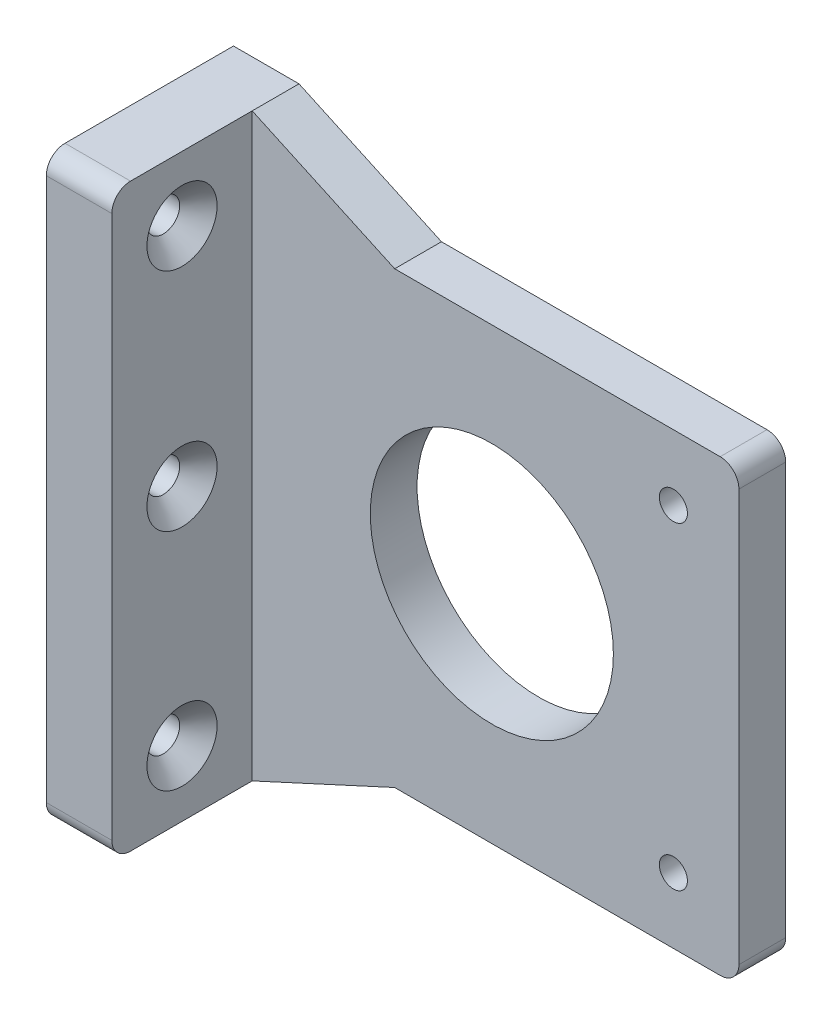
ISO-10303-21;
HEADER;
FILE_DESCRIPTION(('STEP AP214'),'2;1');
FILE_NAME('part.step','',(''),(''),'','','');
FILE_SCHEMA(('AUTOMOTIVE_DESIGN { 1 0 10303 214 1 1 1 1 }'));
ENDSEC;
DATA;
#1=APPLICATION_CONTEXT('core data for automotive mechanical design processes');
#2=APPLICATION_PROTOCOL_DEFINITION('international standard','automotive_design',2000,#1);
#3=PRODUCT_CONTEXT('',#1,'mechanical');
#4=PRODUCT('Part','Part','',(#3));
#5=PRODUCT_RELATED_PRODUCT_CATEGORY('part','',(#4));
#6=PRODUCT_DEFINITION_FORMATION('','',#4);
#7=PRODUCT_DEFINITION_CONTEXT('part definition',#1,'design');
#8=PRODUCT_DEFINITION('design','',#6,#7);
#9=PRODUCT_DEFINITION_SHAPE('','',#8);
#10=(LENGTH_UNIT() NAMED_UNIT(*) SI_UNIT(.MILLI.,.METRE.));
#11=(NAMED_UNIT(*) PLANE_ANGLE_UNIT() SI_UNIT($,.RADIAN.));
#12=(NAMED_UNIT(*) SI_UNIT($,.STERADIAN.) SOLID_ANGLE_UNIT());
#13=UNCERTAINTY_MEASURE_WITH_UNIT(LENGTH_MEASURE(1.E-05),#10,'distance_accuracy_value','');
#14=(GEOMETRIC_REPRESENTATION_CONTEXT(3) GLOBAL_UNCERTAINTY_ASSIGNED_CONTEXT((#13)) GLOBAL_UNIT_ASSIGNED_CONTEXT((#10,
#11,#12)) REPRESENTATION_CONTEXT('',''));
#15=CARTESIAN_POINT('',(0.,0.,0.));
#16=DIRECTION('',(0.,0.,1.));
#17=DIRECTION('',(1.,0.,0.));
#18=AXIS2_PLACEMENT_3D('',#15,#16,#17);
#19=CARTESIAN_POINT('',(-10.9580010754682,23.8294035119056,5.));
#20=DIRECTION('',(0.417794694081964,-0.908541464984927,0.));
#21=DIRECTION('',(0.908541464984927,0.417794694081964,0.));
#22=AXIS2_PLACEMENT_3D('',#19,#20,#21);
#23=PLANE('',#22);
#24=DIRECTION('',(-0.908541464984927,-0.417794694081964,0.));
#25=VECTOR('',#24,1.);
#26=CARTESIAN_POINT('',(-10.9580010754682,23.8294035119056,0.));
#27=LINE('',#26,#25);
#28=CARTESIAN_POINT('',(-62.7777141620501,0.,0.));
#29=VERTEX_POINT('',#28);
#30=CARTESIAN_POINT('',(-78.,-7.,0.));
#31=VERTEX_POINT('',#30);
#32=EDGE_CURVE('E162',#29,#31,#27,.T.);
#33=ORIENTED_EDGE('',*,*,#32,.F.);
#34=DIRECTION('',(0.,0.,-1.));
#35=VECTOR('',#34,1.);
#36=CARTESIAN_POINT('',(-62.7777141620501,0.,5.));
#37=LINE('',#36,#35);
#38=CARTESIAN_POINT('',(-62.7777141620501,0.,5.));
#39=VERTEX_POINT('',#38);
#40=EDGE_CURVE('E175',#39,#29,#37,.T.);
#41=ORIENTED_EDGE('',*,*,#40,.F.);
#42=DIRECTION('',(-0.908541464984927,-0.417794694081964,0.));
#43=VECTOR('',#42,1.);
#44=CARTESIAN_POINT('',(-10.9580010754682,23.8294035119056,5.));
#45=LINE('',#44,#43);
#46=CARTESIAN_POINT('',(-78.,-7.,5.));
#47=VERTEX_POINT('',#46);
#48=EDGE_CURVE('E158',#39,#47,#45,.T.);
#49=ORIENTED_EDGE('',*,*,#48,.T.);
#50=DIRECTION('',(0.,0.,-1.));
#51=VECTOR('',#50,1.);
#52=CARTESIAN_POINT('',(-78.,-7.,5.));
#53=LINE('',#52,#51);
#54=EDGE_CURVE('E165',#47,#31,#53,.T.);
#55=ORIENTED_EDGE('',*,*,#54,.T.);
#56=EDGE_LOOP('',(#33,#41,#49,#55));
#57=FACE_BOUND('',#56,.T.);
#58=ADVANCED_FACE('F39',(#57),#23,.T.);
#59=CARTESIAN_POINT('',(0.,0.,5.));
#60=DIRECTION('',(0.,1.,0.));
#61=DIRECTION('',(0.,0.,1.));
#62=AXIS2_PLACEMENT_3D('',#59,#60,#61);
#63=PLANE('',#62);
#64=DIRECTION('',(1.,0.,0.));
#65=VECTOR('',#64,1.);
#66=CARTESIAN_POINT('',(0.,0.,0.));
#67=LINE('',#66,#65);
#68=CARTESIAN_POINT('',(-28.,0.,0.));
#69=VERTEX_POINT('',#68);
#70=EDGE_CURVE('E199',#29,#69,#67,.T.);
#71=ORIENTED_EDGE('',*,*,#70,.T.);
#72=DIRECTION('',(0.,0.,-1.));
#73=VECTOR('',#72,1.);
#74=CARTESIAN_POINT('',(-28.,0.,5.));
#75=LINE('',#74,#73);
#76=CARTESIAN_POINT('',(-28.,0.,5.));
#77=VERTEX_POINT('',#76);
#78=EDGE_CURVE('E255',#69,#77,#75,.F.);
#79=ORIENTED_EDGE('',*,*,#78,.T.);
#80=DIRECTION('',(1.,0.,0.));
#81=VECTOR('',#80,1.);
#82=CARTESIAN_POINT('',(0.,0.,5.));
#83=LINE('',#82,#81);
#84=EDGE_CURVE('E177',#39,#77,#83,.T.);
#85=ORIENTED_EDGE('',*,*,#84,.F.);
#86=ORIENTED_EDGE('',*,*,#40,.T.);
#87=EDGE_LOOP('',(#71,#79,#85,#86));
#88=FACE_BOUND('',#87,.T.);
#89=ADVANCED_FACE('F312',(#88),#63,.F.);
#90=CARTESIAN_POINT('',(-26.,0.,5.));
#91=DIRECTION('',(1.,0.,0.));
#92=DIRECTION('',(0.,0.,-1.));
#93=AXIS2_PLACEMENT_3D('',#90,#91,#92);
#94=PLANE('',#93);
#95=DIRECTION('',(0.,-1.,0.));
#96=VECTOR('',#95,1.);
#97=CARTESIAN_POINT('',(-26.,0.,5.));
#98=LINE('',#97,#96);
#99=CARTESIAN_POINT('',(-26.,46.,5.));
#100=VERTEX_POINT('',#99);
#101=CARTESIAN_POINT('',(-26.,2.,5.));
#102=VERTEX_POINT('',#101);
#103=EDGE_CURVE('E180',#100,#102,#98,.T.);
#104=ORIENTED_EDGE('',*,*,#103,.T.);
#105=DIRECTION('',(0.,0.,-1.));
#106=VECTOR('',#105,1.);
#107=CARTESIAN_POINT('',(-26.,2.,0.));
#108=LINE('',#107,#106);
#109=CARTESIAN_POINT('',(-26.,2.,0.));
#110=VERTEX_POINT('',#109);
#111=EDGE_CURVE('E248',#102,#110,#108,.T.);
#112=ORIENTED_EDGE('',*,*,#111,.T.);
#113=DIRECTION('',(0.,-1.,0.));
#114=VECTOR('',#113,1.);
#115=CARTESIAN_POINT('',(-26.,0.,0.));
#116=LINE('',#115,#114);
#117=CARTESIAN_POINT('',(-26.,46.,0.));
#118=VERTEX_POINT('',#117);
#119=EDGE_CURVE('E202',#118,#110,#116,.T.);
#120=ORIENTED_EDGE('',*,*,#119,.F.);
#121=DIRECTION('',(0.,0.,-1.));
#122=VECTOR('',#121,1.);
#123=CARTESIAN_POINT('',(-26.,46.,5.));
#124=LINE('',#123,#122);
#125=EDGE_CURVE('E246',#118,#100,#124,.F.);
#126=ORIENTED_EDGE('',*,*,#125,.T.);
#127=EDGE_LOOP('',(#104,#112,#120,#126));
#128=FACE_BOUND('',#127,.T.);
#129=ADVANCED_FACE('F317',(#128),#94,.T.);
#130=CARTESIAN_POINT('',(0.,48.,5.));
#131=DIRECTION('',(0.,1.,0.));
#132=DIRECTION('',(0.,0.,1.));
#133=AXIS2_PLACEMENT_3D('',#130,#131,#132);
#134=PLANE('',#133);
#135=DIRECTION('',(1.,0.,0.));
#136=VECTOR('',#135,1.);
#137=CARTESIAN_POINT('',(0.,48.,5.));
#138=LINE('',#137,#136);
#139=CARTESIAN_POINT('',(-62.7777141620501,48.,5.));
#140=VERTEX_POINT('',#139);
#141=CARTESIAN_POINT('',(-28.,48.,5.));
#142=VERTEX_POINT('',#141);
#143=EDGE_CURVE('E189',#140,#142,#138,.T.);
#144=ORIENTED_EDGE('',*,*,#143,.T.);
#145=DIRECTION('',(0.,0.,-1.));
#146=VECTOR('',#145,1.);
#147=CARTESIAN_POINT('',(-28.,48.,5.));
#148=LINE('',#147,#146);
#149=CARTESIAN_POINT('',(-28.,48.,0.));
#150=VERTEX_POINT('',#149);
#151=EDGE_CURVE('E261',#142,#150,#148,.T.);
#152=ORIENTED_EDGE('',*,*,#151,.T.);
#153=DIRECTION('',(1.,0.,0.));
#154=VECTOR('',#153,1.);
#155=CARTESIAN_POINT('',(0.,48.,0.));
#156=LINE('',#155,#154);
#157=CARTESIAN_POINT('',(-62.7777141620501,48.,0.));
#158=VERTEX_POINT('',#157);
#159=EDGE_CURVE('E205',#158,#150,#156,.T.);
#160=ORIENTED_EDGE('',*,*,#159,.F.);
#161=DIRECTION('',(0.,0.,-1.));
#162=VECTOR('',#161,1.);
#163=CARTESIAN_POINT('',(-62.7777141620501,48.,5.));
#164=LINE('',#163,#162);
#165=EDGE_CURVE('E225',#140,#158,#164,.T.);
#166=ORIENTED_EDGE('',*,*,#165,.F.);
#167=EDGE_LOOP('',(#144,#152,#160,#166));
#168=FACE_BOUND('',#167,.T.);
#169=ADVANCED_FACE('F348',(#168),#134,.T.);
#170=CARTESIAN_POINT('',(7.26202148889138,15.7920809807484,5.));
#171=DIRECTION('',(0.417794694081964,0.908541464984927,0.));
#172=DIRECTION('',(-0.908541464984927,0.417794694081964,0.));
#173=AXIS2_PLACEMENT_3D('',#170,#171,#172);
#174=PLANE('',#173);
#175=DIRECTION('',(0.908541464984927,-0.417794694081964,0.));
#176=VECTOR('',#175,1.);
#177=CARTESIAN_POINT('',(7.26202148889138,15.7920809807484,0.));
#178=LINE('',#177,#176);
#179=CARTESIAN_POINT('',(-78.,55.,0.));
#180=VERTEX_POINT('',#179);
#181=EDGE_CURVE('E208',#180,#158,#178,.T.);
#182=ORIENTED_EDGE('',*,*,#181,.F.);
#183=DIRECTION('',(0.,0.,-1.));
#184=VECTOR('',#183,1.);
#185=CARTESIAN_POINT('',(-78.,55.,5.));
#186=LINE('',#185,#184);
#187=CARTESIAN_POINT('',(-78.,55.,5.));
#188=VERTEX_POINT('',#187);
#189=EDGE_CURVE('E223',#188,#180,#186,.T.);
#190=ORIENTED_EDGE('',*,*,#189,.F.);
#191=DIRECTION('',(0.908541464984927,-0.417794694081964,0.));
#192=VECTOR('',#191,1.);
#193=CARTESIAN_POINT('',(7.26202148889138,15.7920809807484,5.));
#194=LINE('',#193,#192);
#195=EDGE_CURVE('E161',#188,#140,#194,.T.);
#196=ORIENTED_EDGE('',*,*,#195,.T.);
#197=ORIENTED_EDGE('',*,*,#165,.T.);
#198=EDGE_LOOP('',(#182,#190,#196,#197));
#199=FACE_BOUND('',#198,.T.);
#200=ADVANCED_FACE('F296',(#199),#174,.T.);
#201=CARTESIAN_POINT('',(0.,55.,5.));
#202=DIRECTION('',(0.,1.,0.));
#203=DIRECTION('',(0.,0.,1.));
#204=AXIS2_PLACEMENT_3D('',#201,#202,#203);
#205=PLANE('',#204);
#206=DIRECTION('',(0.,0.,-1.));
#207=VECTOR('',#206,1.);
#208=CARTESIAN_POINT('',(-85.,55.,5.));
#209=LINE('',#208,#207);
#210=CARTESIAN_POINT('',(-85.,55.,18.));
#211=VERTEX_POINT('',#210);
#212=CARTESIAN_POINT('',(-85.,55.,0.));
#213=VERTEX_POINT('',#212);
#214=EDGE_CURVE('E221',#211,#213,#209,.T.);
#215=ORIENTED_EDGE('',*,*,#214,.F.);
#216=DIRECTION('',(1.,0.,0.));
#217=VECTOR('',#216,1.);
#218=CARTESIAN_POINT('',(0.,55.,18.));
#219=LINE('',#218,#217);
#220=CARTESIAN_POINT('',(-78.,55.,18.));
#221=VERTEX_POINT('',#220);
#222=EDGE_CURVE('E264',#211,#221,#219,.T.);
#223=ORIENTED_EDGE('',*,*,#222,.T.);
#224=DIRECTION('',(0.,0.,-1.));
#225=VECTOR('',#224,1.);
#226=CARTESIAN_POINT('',(-78.,55.,20.));
#227=LINE('',#226,#225);
#228=EDGE_CURVE('E148',#221,#188,#227,.T.);
#229=ORIENTED_EDGE('',*,*,#228,.T.);
#230=ORIENTED_EDGE('',*,*,#189,.T.);
#231=DIRECTION('',(1.,0.,0.));
#232=VECTOR('',#231,1.);
#233=CARTESIAN_POINT('',(0.,55.,0.));
#234=LINE('',#233,#232);
#235=EDGE_CURVE('E211',#213,#180,#234,.T.);
#236=ORIENTED_EDGE('',*,*,#235,.F.);
#237=EDGE_LOOP('',(#215,#223,#229,#230,#236));
#238=FACE_BOUND('',#237,.T.);
#239=ADVANCED_FACE('F283',(#238),#205,.T.);
#240=CARTESIAN_POINT('',(-85.,0.,5.));
#241=DIRECTION('',(-1.,0.,0.));
#242=DIRECTION('',(0.,0.,1.));
#243=AXIS2_PLACEMENT_3D('',#240,#241,#242);
#244=PLANE('',#243);
#245=CARTESIAN_POINT('',(-85.,24.,12.5));
#246=DIRECTION('',(-1.,0.,0.));
#247=DIRECTION('',(0.,0.,1.));
#248=AXIS2_PLACEMENT_3D('',#245,#246,#247);
#249=CIRCLE('',#248,1.75);
#250=CARTESIAN_POINT('',(-85.,24.,14.25));
#251=VERTEX_POINT('',#250);
#252=EDGE_CURVE('E291',#251,#251,#249,.T.);
#253=ORIENTED_EDGE('',*,*,#252,.F.);
#254=EDGE_LOOP('',(#253));
#255=FACE_BOUND('',#254,.T.);
#256=CARTESIAN_POINT('',(-85.,48.1060776493848,12.5));
#257=DIRECTION('',(-1.,0.,0.));
#258=DIRECTION('',(0.,0.,1.));
#259=AXIS2_PLACEMENT_3D('',#256,#257,#258);
#260=CIRCLE('',#259,1.75);
#261=CARTESIAN_POINT('',(-85.,48.1060776493848,14.25));
#262=VERTEX_POINT('',#261);
#263=EDGE_CURVE('E405',#262,#262,#260,.T.);
#264=ORIENTED_EDGE('',*,*,#263,.F.);
#265=EDGE_LOOP('',(#264));
#266=FACE_BOUND('',#265,.T.);
#267=CARTESIAN_POINT('',(-85.,0.,12.5));
#268=DIRECTION('',(-1.,0.,0.));
#269=DIRECTION('',(0.,0.,1.));
#270=AXIS2_PLACEMENT_3D('',#267,#268,#269);
#271=CIRCLE('',#270,1.75);
#272=CARTESIAN_POINT('',(-85.,0.,14.25));
#273=VERTEX_POINT('',#272);
#274=EDGE_CURVE('E287',#273,#273,#271,.T.);
#275=ORIENTED_EDGE('',*,*,#274,.F.);
#276=EDGE_LOOP('',(#275));
#277=FACE_BOUND('',#276,.T.);
#278=DIRECTION('',(0.,1.,0.));
#279=VECTOR('',#278,1.);
#280=CARTESIAN_POINT('',(-85.,0.,20.));
#281=LINE('',#280,#279);
#282=CARTESIAN_POINT('',(-85.,-5.,20.));
#283=VERTEX_POINT('',#282);
#284=CARTESIAN_POINT('',(-85.,53.,20.));
#285=VERTEX_POINT('',#284);
#286=EDGE_CURVE('E149',#283,#285,#281,.T.);
#287=ORIENTED_EDGE('',*,*,#286,.T.);
#288=CARTESIAN_POINT('',(-85.,53.,18.));
#289=DIRECTION('',(-1.,0.,0.));
#290=DIRECTION('',(0.,0.,1.));
#291=AXIS2_PLACEMENT_3D('',#288,#289,#290);
#292=CIRCLE('',#291,2.);
#293=EDGE_CURVE('E48',#285,#211,#292,.T.);
#294=ORIENTED_EDGE('',*,*,#293,.T.);
#295=ORIENTED_EDGE('',*,*,#214,.T.);
#296=DIRECTION('',(0.,1.,0.));
#297=VECTOR('',#296,1.);
#298=CARTESIAN_POINT('',(-85.,0.,0.));
#299=LINE('',#298,#297);
#300=CARTESIAN_POINT('',(-85.,-7.,0.));
#301=VERTEX_POINT('',#300);
#302=EDGE_CURVE('E214',#301,#213,#299,.T.);
#303=ORIENTED_EDGE('',*,*,#302,.F.);
#304=DIRECTION('',(0.,0.,-1.));
#305=VECTOR('',#304,1.);
#306=CARTESIAN_POINT('',(-85.,-7.,5.));
#307=LINE('',#306,#305);
#308=CARTESIAN_POINT('',(-85.,-7.,18.));
#309=VERTEX_POINT('',#308);
#310=EDGE_CURVE('E172',#309,#301,#307,.T.);
#311=ORIENTED_EDGE('',*,*,#310,.F.);
#312=CARTESIAN_POINT('',(-85.,-5.,18.));
#313=DIRECTION('',(-1.,0.,0.));
#314=DIRECTION('',(0.,0.,1.));
#315=AXIS2_PLACEMENT_3D('',#312,#313,#314);
#316=CIRCLE('',#315,2.);
#317=EDGE_CURVE('E55',#309,#283,#316,.T.);
#318=ORIENTED_EDGE('',*,*,#317,.T.);
#319=EDGE_LOOP('',(#287,#294,#295,#303,#311,#318));
#320=FACE_BOUND('',#319,.T.);
#321=ADVANCED_FACE('F277',(#255,#266,#277,#320),#244,.T.);
#322=CARTESIAN_POINT('',(-33.,41.,5.));
#323=DIRECTION('',(0.,0.,-1.));
#324=DIRECTION('',(-1.,0.,0.));
#325=AXIS2_PLACEMENT_3D('',#322,#323,#324);
#326=CYLINDRICAL_SURFACE('',#325,1.5);
#327=CARTESIAN_POINT('',(-33.,41.,5.));
#328=DIRECTION('',(0.,0.,1.));
#329=DIRECTION('',(1.,0.,0.));
#330=AXIS2_PLACEMENT_3D('',#327,#328,#329);
#331=CIRCLE('',#330,1.5);
#332=CARTESIAN_POINT('',(-31.5,41.,5.));
#333=VERTEX_POINT('',#332);
#334=EDGE_CURVE('E193',#333,#333,#331,.T.);
#335=ORIENTED_EDGE('',*,*,#334,.T.);
#336=EDGE_LOOP('',(#335));
#337=FACE_BOUND('',#336,.T.);
#338=CARTESIAN_POINT('',(-33.,41.,0.));
#339=DIRECTION('',(0.,0.,1.));
#340=DIRECTION('',(1.,0.,0.));
#341=AXIS2_PLACEMENT_3D('',#338,#339,#340);
#342=CIRCLE('',#341,1.5);
#343=CARTESIAN_POINT('',(-31.5,41.,0.));
#344=VERTEX_POINT('',#343);
#345=EDGE_CURVE('E183',#344,#344,#342,.T.);
#346=ORIENTED_EDGE('',*,*,#345,.F.);
#347=EDGE_LOOP('',(#346));
#348=FACE_BOUND('',#347,.T.);
#349=ADVANCED_FACE('F367',(#337,#348),#326,.F.);
#350=CARTESIAN_POINT('',(0.,-7.,5.));
#351=DIRECTION('',(0.,-1.,0.));
#352=DIRECTION('',(0.,0.,-1.));
#353=AXIS2_PLACEMENT_3D('',#350,#351,#352);
#354=PLANE('',#353);
#355=DIRECTION('',(0.,0.,-1.));
#356=VECTOR('',#355,1.);
#357=CARTESIAN_POINT('',(-78.,-7.,20.));
#358=LINE('',#357,#356);
#359=CARTESIAN_POINT('',(-78.,-7.,18.));
#360=VERTEX_POINT('',#359);
#361=EDGE_CURVE('E137',#360,#47,#358,.T.);
#362=ORIENTED_EDGE('',*,*,#361,.F.);
#363=DIRECTION('',(-1.,0.,0.));
#364=VECTOR('',#363,1.);
#365=CARTESIAN_POINT('',(0.,-7.,18.));
#366=LINE('',#365,#364);
#367=EDGE_CURVE('E11',#360,#309,#366,.T.);
#368=ORIENTED_EDGE('',*,*,#367,.T.);
#369=ORIENTED_EDGE('',*,*,#310,.T.);
#370=DIRECTION('',(-1.,0.,0.));
#371=VECTOR('',#370,1.);
#372=CARTESIAN_POINT('',(0.,-7.,0.));
#373=LINE('',#372,#371);
#374=EDGE_CURVE('E168',#31,#301,#373,.T.);
#375=ORIENTED_EDGE('',*,*,#374,.F.);
#376=ORIENTED_EDGE('',*,*,#54,.F.);
#377=EDGE_LOOP('',(#362,#368,#369,#375,#376));
#378=FACE_BOUND('',#377,.T.);
#379=ADVANCED_FACE('F166',(#378),#354,.T.);
#380=CARTESIAN_POINT('',(-33.,7.,5.));
#381=DIRECTION('',(0.,0.,-1.));
#382=DIRECTION('',(-1.,0.,0.));
#383=AXIS2_PLACEMENT_3D('',#380,#381,#382);
#384=CYLINDRICAL_SURFACE('',#383,1.5);
#385=CARTESIAN_POINT('',(-33.,7.,5.));
#386=DIRECTION('',(0.,0.,1.));
#387=DIRECTION('',(1.,0.,0.));
#388=AXIS2_PLACEMENT_3D('',#385,#386,#387);
#389=CIRCLE('',#388,1.5);
#390=CARTESIAN_POINT('',(-31.5,7.,5.));
#391=VERTEX_POINT('',#390);
#392=EDGE_CURVE('E173',#391,#391,#389,.T.);
#393=ORIENTED_EDGE('',*,*,#392,.T.);
#394=EDGE_LOOP('',(#393));
#395=FACE_BOUND('',#394,.T.);
#396=CARTESIAN_POINT('',(-33.,7.,0.));
#397=DIRECTION('',(0.,0.,1.));
#398=DIRECTION('',(1.,0.,0.));
#399=AXIS2_PLACEMENT_3D('',#396,#397,#398);
#400=CIRCLE('',#399,1.5);
#401=CARTESIAN_POINT('',(-31.5,7.,0.));
#402=VERTEX_POINT('',#401);
#403=EDGE_CURVE('E178',#402,#402,#400,.T.);
#404=ORIENTED_EDGE('',*,*,#403,.F.);
#405=EDGE_LOOP('',(#404));
#406=FACE_BOUND('',#405,.T.);
#407=ADVANCED_FACE('F371',(#395,#406),#384,.F.);
#408=CARTESIAN_POINT('',(0.,0.,5.));
#409=DIRECTION('',(0.,0.,1.));
#410=DIRECTION('',(1.,0.,0.));
#411=AXIS2_PLACEMENT_3D('',#408,#409,#410);
#412=PLANE('',#411);
#413=CARTESIAN_POINT('',(-52.3975878328754,24.0414663886078,5.));
#414=DIRECTION('',(0.,0.,1.));
#415=DIRECTION('',(1.,0.,0.));
#416=AXIS2_PLACEMENT_3D('',#413,#414,#415);
#417=CIRCLE('',#416,12.9863302191005);
#418=CARTESIAN_POINT('',(-39.411257613775,24.0414663886078,5.));
#419=VERTEX_POINT('',#418);
#420=EDGE_CURVE('E409',#419,#419,#417,.T.);
#421=ORIENTED_EDGE('',*,*,#420,.F.);
#422=EDGE_LOOP('',(#421));
#423=FACE_BOUND('',#422,.T.);
#424=ORIENTED_EDGE('',*,*,#84,.T.);
#425=CARTESIAN_POINT('',(-28.,2.,5.));
#426=DIRECTION('',(0.,0.,1.));
#427=DIRECTION('',(1.,0.,0.));
#428=AXIS2_PLACEMENT_3D('',#425,#426,#427);
#429=CIRCLE('',#428,2.);
#430=EDGE_CURVE('E259',#77,#102,#429,.T.);
#431=ORIENTED_EDGE('',*,*,#430,.T.);
#432=ORIENTED_EDGE('',*,*,#103,.F.);
#433=CARTESIAN_POINT('',(-28.,46.,5.));
#434=DIRECTION('',(0.,0.,1.));
#435=DIRECTION('',(1.,0.,0.));
#436=AXIS2_PLACEMENT_3D('',#433,#434,#435);
#437=CIRCLE('',#436,2.);
#438=EDGE_CURVE('E257',#100,#142,#437,.T.);
#439=ORIENTED_EDGE('',*,*,#438,.T.);
#440=ORIENTED_EDGE('',*,*,#143,.F.);
#441=ORIENTED_EDGE('',*,*,#195,.F.);
#442=DIRECTION('',(0.,1.,0.));
#443=VECTOR('',#442,1.);
#444=CARTESIAN_POINT('',(-78.,0.,5.));
#445=LINE('',#444,#443);
#446=EDGE_CURVE('E141',#47,#188,#445,.T.);
#447=ORIENTED_EDGE('',*,*,#446,.F.);
#448=ORIENTED_EDGE('',*,*,#48,.F.);
#449=EDGE_LOOP('',(#424,#431,#432,#439,#440,#441,#447,#448));
#450=FACE_BOUND('',#449,.T.);
#451=ORIENTED_EDGE('',*,*,#334,.F.);
#452=EDGE_LOOP('',(#451));
#453=FACE_BOUND('',#452,.T.);
#454=ORIENTED_EDGE('',*,*,#392,.F.);
#455=EDGE_LOOP('',(#454));
#456=FACE_BOUND('',#455,.T.);
#457=ADVANCED_FACE('F155',(#423,#450,#453,#456),#412,.T.);
#458=CARTESIAN_POINT('',(0.,0.,0.));
#459=DIRECTION('',(0.,0.,1.));
#460=DIRECTION('',(1.,0.,0.));
#461=AXIS2_PLACEMENT_3D('',#458,#459,#460);
#462=PLANE('',#461);
#463=CARTESIAN_POINT('',(-52.3975878328754,24.0414663886078,0.));
#464=DIRECTION('',(0.,0.,1.));
#465=DIRECTION('',(1.,0.,0.));
#466=AXIS2_PLACEMENT_3D('',#463,#464,#465);
#467=CIRCLE('',#466,12.9863302191005);
#468=CARTESIAN_POINT('',(-39.411257613775,24.0414663886078,0.));
#469=VERTEX_POINT('',#468);
#470=EDGE_CURVE('E43',#469,#469,#467,.T.);
#471=ORIENTED_EDGE('',*,*,#470,.T.);
#472=EDGE_LOOP('',(#471));
#473=FACE_BOUND('',#472,.T.);
#474=ORIENTED_EDGE('',*,*,#119,.T.);
#475=CARTESIAN_POINT('',(-28.,2.,0.));
#476=DIRECTION('',(0.,0.,1.));
#477=DIRECTION('',(1.,0.,0.));
#478=AXIS2_PLACEMENT_3D('',#475,#476,#477);
#479=CIRCLE('',#478,2.);
#480=EDGE_CURVE('E253',#110,#69,#479,.F.);
#481=ORIENTED_EDGE('',*,*,#480,.T.);
#482=ORIENTED_EDGE('',*,*,#70,.F.);
#483=ORIENTED_EDGE('',*,*,#32,.T.);
#484=ORIENTED_EDGE('',*,*,#374,.T.);
#485=ORIENTED_EDGE('',*,*,#302,.T.);
#486=ORIENTED_EDGE('',*,*,#235,.T.);
#487=ORIENTED_EDGE('',*,*,#181,.T.);
#488=ORIENTED_EDGE('',*,*,#159,.T.);
#489=CARTESIAN_POINT('',(-28.,46.,0.));
#490=DIRECTION('',(0.,0.,1.));
#491=DIRECTION('',(1.,0.,0.));
#492=AXIS2_PLACEMENT_3D('',#489,#490,#491);
#493=CIRCLE('',#492,2.);
#494=EDGE_CURVE('E251',#150,#118,#493,.F.);
#495=ORIENTED_EDGE('',*,*,#494,.T.);
#496=EDGE_LOOP('',(#474,#481,#482,#483,#484,#485,#486,#487,#488,#495));
#497=FACE_BOUND('',#496,.T.);
#498=ORIENTED_EDGE('',*,*,#345,.T.);
#499=EDGE_LOOP('',(#498));
#500=FACE_BOUND('',#499,.T.);
#501=ORIENTED_EDGE('',*,*,#403,.T.);
#502=EDGE_LOOP('',(#501));
#503=FACE_BOUND('',#502,.T.);
#504=ADVANCED_FACE('F299',(#473,#497,#500,#503),#462,.F.);
#505=CARTESIAN_POINT('',(-78.,0.,20.));
#506=DIRECTION('',(1.,0.,0.));
#507=DIRECTION('',(0.,0.,-1.));
#508=AXIS2_PLACEMENT_3D('',#505,#506,#507);
#509=PLANE('',#508);
#510=CARTESIAN_POINT('',(-78.,48.1060776493848,12.5));
#511=DIRECTION('',(1.,0.,0.));
#512=DIRECTION('',(0.,0.,-1.));
#513=AXIS2_PLACEMENT_3D('',#510,#511,#512);
#514=CIRCLE('',#513,3.75);
#515=CARTESIAN_POINT('',(-78.,48.1060776493848,8.75));
#516=VERTEX_POINT('',#515);
#517=EDGE_CURVE('E237',#516,#516,#514,.F.);
#518=ORIENTED_EDGE('',*,*,#517,.T.);
#519=EDGE_LOOP('',(#518));
#520=FACE_BOUND('',#519,.T.);
#521=CARTESIAN_POINT('',(-78.,24.,12.5));
#522=DIRECTION('',(1.,0.,0.));
#523=DIRECTION('',(0.,0.,-1.));
#524=AXIS2_PLACEMENT_3D('',#521,#522,#523);
#525=CIRCLE('',#524,3.75);
#526=CARTESIAN_POINT('',(-78.,24.,8.75));
#527=VERTEX_POINT('',#526);
#528=EDGE_CURVE('E234',#527,#527,#525,.F.);
#529=ORIENTED_EDGE('',*,*,#528,.T.);
#530=EDGE_LOOP('',(#529));
#531=FACE_BOUND('',#530,.T.);
#532=CARTESIAN_POINT('',(-78.,0.,12.5));
#533=DIRECTION('',(1.,0.,0.));
#534=DIRECTION('',(0.,0.,-1.));
#535=AXIS2_PLACEMENT_3D('',#532,#533,#534);
#536=CIRCLE('',#535,3.75);
#537=CARTESIAN_POINT('',(-78.,0.,8.75));
#538=VERTEX_POINT('',#537);
#539=EDGE_CURVE('E231',#538,#538,#536,.F.);
#540=ORIENTED_EDGE('',*,*,#539,.T.);
#541=EDGE_LOOP('',(#540));
#542=FACE_BOUND('',#541,.T.);
#543=ORIENTED_EDGE('',*,*,#228,.F.);
#544=CARTESIAN_POINT('',(-78.,53.,18.));
#545=DIRECTION('',(1.,0.,0.));
#546=DIRECTION('',(0.,0.,-1.));
#547=AXIS2_PLACEMENT_3D('',#544,#545,#546);
#548=CIRCLE('',#547,2.);
#549=CARTESIAN_POINT('',(-78.,53.,20.));
#550=VERTEX_POINT('',#549);
#551=EDGE_CURVE('E268',#221,#550,#548,.T.);
#552=ORIENTED_EDGE('',*,*,#551,.T.);
#553=DIRECTION('',(0.,-1.,0.));
#554=VECTOR('',#553,1.);
#555=CARTESIAN_POINT('',(-78.,0.,20.));
#556=LINE('',#555,#554);
#557=CARTESIAN_POINT('',(-78.,-5.,20.));
#558=VERTEX_POINT('',#557);
#559=EDGE_CURVE('E285',#550,#558,#556,.T.);
#560=ORIENTED_EDGE('',*,*,#559,.T.);
#561=CARTESIAN_POINT('',(-78.,-5.,18.));
#562=DIRECTION('',(1.,0.,0.));
#563=DIRECTION('',(0.,0.,-1.));
#564=AXIS2_PLACEMENT_3D('',#561,#562,#563);
#565=CIRCLE('',#564,2.);
#566=EDGE_CURVE('E145',#558,#360,#565,.T.);
#567=ORIENTED_EDGE('',*,*,#566,.T.);
#568=ORIENTED_EDGE('',*,*,#361,.T.);
#569=ORIENTED_EDGE('',*,*,#446,.T.);
#570=EDGE_LOOP('',(#543,#552,#560,#567,#568,#569));
#571=FACE_BOUND('',#570,.T.);
#572=ADVANCED_FACE('F140',(#520,#531,#542,#571),#509,.T.);
#573=CARTESIAN_POINT('',(0.,0.,20.));
#574=DIRECTION('',(0.,0.,1.));
#575=DIRECTION('',(1.,0.,0.));
#576=AXIS2_PLACEMENT_3D('',#573,#574,#575);
#577=PLANE('',#576);
#578=ORIENTED_EDGE('',*,*,#559,.F.);
#579=DIRECTION('',(1.,0.,0.));
#580=VECTOR('',#579,1.);
#581=CARTESIAN_POINT('',(0.,53.,20.));
#582=LINE('',#581,#580);
#583=EDGE_CURVE('E62',#550,#285,#582,.F.);
#584=ORIENTED_EDGE('',*,*,#583,.T.);
#585=ORIENTED_EDGE('',*,*,#286,.F.);
#586=DIRECTION('',(-1.,0.,0.));
#587=VECTOR('',#586,1.);
#588=CARTESIAN_POINT('',(0.,-5.,20.));
#589=LINE('',#588,#587);
#590=EDGE_CURVE('E270',#283,#558,#589,.F.);
#591=ORIENTED_EDGE('',*,*,#590,.T.);
#592=EDGE_LOOP('',(#578,#584,#585,#591));
#593=FACE_BOUND('',#592,.T.);
#594=ADVANCED_FACE('F286',(#593),#577,.T.);
#595=CARTESIAN_POINT('',(-96.,0.,12.5));
#596=DIRECTION('',(1.,0.,0.));
#597=DIRECTION('',(0.,0.,-1.));
#598=AXIS2_PLACEMENT_3D('',#595,#596,#597);
#599=CYLINDRICAL_SURFACE('',#598,1.75);
#600=CARTESIAN_POINT('',(-80.,0.,12.5));
#601=DIRECTION('',(1.,0.,0.));
#602=DIRECTION('',(0.,0.,-1.));
#603=AXIS2_PLACEMENT_3D('',#600,#601,#602);
#604=CIRCLE('',#603,1.75);
#605=CARTESIAN_POINT('',(-80.,0.,10.75));
#606=VERTEX_POINT('',#605);
#607=EDGE_CURVE('E243',#606,#606,#604,.T.);
#608=ORIENTED_EDGE('',*,*,#607,.T.);
#609=EDGE_LOOP('',(#608));
#610=FACE_BOUND('',#609,.T.);
#611=ORIENTED_EDGE('',*,*,#274,.T.);
#612=EDGE_LOOP('',(#611));
#613=FACE_BOUND('',#612,.T.);
#614=ADVANCED_FACE('F389',(#610,#613),#599,.F.);
#615=CARTESIAN_POINT('',(-96.,48.1060776493848,12.5));
#616=DIRECTION('',(1.,0.,0.));
#617=DIRECTION('',(0.,0.,-1.));
#618=AXIS2_PLACEMENT_3D('',#615,#616,#617);
#619=CYLINDRICAL_SURFACE('',#618,1.75);
#620=CARTESIAN_POINT('',(-80.,48.1060776493848,12.5));
#621=DIRECTION('',(1.,0.,0.));
#622=DIRECTION('',(0.,0.,-1.));
#623=AXIS2_PLACEMENT_3D('',#620,#621,#622);
#624=CIRCLE('',#623,1.75);
#625=CARTESIAN_POINT('',(-80.,48.1060776493848,10.75));
#626=VERTEX_POINT('',#625);
#627=EDGE_CURVE('E228',#626,#626,#624,.T.);
#628=ORIENTED_EDGE('',*,*,#627,.T.);
#629=EDGE_LOOP('',(#628));
#630=FACE_BOUND('',#629,.T.);
#631=ORIENTED_EDGE('',*,*,#263,.T.);
#632=EDGE_LOOP('',(#631));
#633=FACE_BOUND('',#632,.T.);
#634=ADVANCED_FACE('F392',(#630,#633),#619,.F.);
#635=CARTESIAN_POINT('',(-96.,24.,12.5));
#636=DIRECTION('',(1.,0.,0.));
#637=DIRECTION('',(0.,0.,-1.));
#638=AXIS2_PLACEMENT_3D('',#635,#636,#637);
#639=CYLINDRICAL_SURFACE('',#638,1.75);
#640=CARTESIAN_POINT('',(-80.,24.,12.5));
#641=DIRECTION('',(1.,0.,0.));
#642=DIRECTION('',(0.,0.,-1.));
#643=AXIS2_PLACEMENT_3D('',#640,#641,#642);
#644=CIRCLE('',#643,1.75);
#645=CARTESIAN_POINT('',(-80.,24.,10.75));
#646=VERTEX_POINT('',#645);
#647=EDGE_CURVE('E240',#646,#646,#644,.T.);
#648=ORIENTED_EDGE('',*,*,#647,.T.);
#649=EDGE_LOOP('',(#648));
#650=FACE_BOUND('',#649,.T.);
#651=ORIENTED_EDGE('',*,*,#252,.T.);
#652=EDGE_LOOP('',(#651));
#653=FACE_BOUND('',#652,.T.);
#654=ADVANCED_FACE('F326',(#650,#653),#639,.F.);
#655=CARTESIAN_POINT('',(-80.,48.1060776493848,12.5));
#656=DIRECTION('',(1.,0.,0.));
#657=DIRECTION('',(0.,0.,-1.));
#658=AXIS2_PLACEMENT_3D('',#655,#656,#657);
#659=CONICAL_SURFACE('',#658,1.75,0.785398163397459);
#660=ORIENTED_EDGE('',*,*,#517,.F.);
#661=EDGE_LOOP('',(#660));
#662=FACE_BOUND('',#661,.T.);
#663=ORIENTED_EDGE('',*,*,#627,.F.);
#664=EDGE_LOOP('',(#663));
#665=FACE_BOUND('',#664,.T.);
#666=ADVANCED_FACE('F322',(#662,#665),#659,.F.);
#667=CARTESIAN_POINT('',(-80.,24.,12.5));
#668=DIRECTION('',(1.,0.,0.));
#669=DIRECTION('',(0.,0.,-1.));
#670=AXIS2_PLACEMENT_3D('',#667,#668,#669);
#671=CONICAL_SURFACE('',#670,1.75,0.785398163397459);
#672=ORIENTED_EDGE('',*,*,#528,.F.);
#673=EDGE_LOOP('',(#672));
#674=FACE_BOUND('',#673,.T.);
#675=ORIENTED_EDGE('',*,*,#647,.F.);
#676=EDGE_LOOP('',(#675));
#677=FACE_BOUND('',#676,.T.);
#678=ADVANCED_FACE('F325',(#674,#677),#671,.F.);
#679=CARTESIAN_POINT('',(-80.,0.,12.5));
#680=DIRECTION('',(1.,0.,0.));
#681=DIRECTION('',(0.,0.,-1.));
#682=AXIS2_PLACEMENT_3D('',#679,#680,#681);
#683=CONICAL_SURFACE('',#682,1.75,0.785398163397459);
#684=ORIENTED_EDGE('',*,*,#539,.F.);
#685=EDGE_LOOP('',(#684));
#686=FACE_BOUND('',#685,.T.);
#687=ORIENTED_EDGE('',*,*,#607,.F.);
#688=EDGE_LOOP('',(#687));
#689=FACE_BOUND('',#688,.T.);
#690=ADVANCED_FACE('F330',(#686,#689),#683,.F.);
#691=CARTESIAN_POINT('',(-28.,2.,5.));
#692=DIRECTION('',(0.,0.,1.));
#693=DIRECTION('',(1.,0.,0.));
#694=AXIS2_PLACEMENT_3D('',#691,#692,#693);
#695=CYLINDRICAL_SURFACE('',#694,2.);
#696=ORIENTED_EDGE('',*,*,#430,.F.);
#697=ORIENTED_EDGE('',*,*,#78,.F.);
#698=ORIENTED_EDGE('',*,*,#480,.F.);
#699=ORIENTED_EDGE('',*,*,#111,.F.);
#700=EDGE_LOOP('',(#696,#697,#698,#699));
#701=FACE_BOUND('',#700,.T.);
#702=ADVANCED_FACE('F334',(#701),#695,.T.);
#703=CARTESIAN_POINT('',(-28.,46.,5.));
#704=DIRECTION('',(0.,0.,-1.));
#705=DIRECTION('',(-1.,0.,0.));
#706=AXIS2_PLACEMENT_3D('',#703,#704,#705);
#707=CYLINDRICAL_SURFACE('',#706,2.);
#708=ORIENTED_EDGE('',*,*,#438,.F.);
#709=ORIENTED_EDGE('',*,*,#125,.F.);
#710=ORIENTED_EDGE('',*,*,#494,.F.);
#711=ORIENTED_EDGE('',*,*,#151,.F.);
#712=EDGE_LOOP('',(#708,#709,#710,#711));
#713=FACE_BOUND('',#712,.T.);
#714=ADVANCED_FACE('F310',(#713),#707,.T.);
#715=CARTESIAN_POINT('',(0.,53.,18.));
#716=DIRECTION('',(1.,0.,0.));
#717=DIRECTION('',(0.,0.,-1.));
#718=AXIS2_PLACEMENT_3D('',#715,#716,#717);
#719=CYLINDRICAL_SURFACE('',#718,2.);
#720=ORIENTED_EDGE('',*,*,#293,.F.);
#721=ORIENTED_EDGE('',*,*,#583,.F.);
#722=ORIENTED_EDGE('',*,*,#551,.F.);
#723=ORIENTED_EDGE('',*,*,#222,.F.);
#724=EDGE_LOOP('',(#720,#721,#722,#723));
#725=FACE_BOUND('',#724,.T.);
#726=ADVANCED_FACE('F284',(#725),#719,.T.);
#727=CARTESIAN_POINT('',(0.,-5.,18.));
#728=DIRECTION('',(-1.,0.,0.));
#729=DIRECTION('',(0.,0.,1.));
#730=AXIS2_PLACEMENT_3D('',#727,#728,#729);
#731=CYLINDRICAL_SURFACE('',#730,2.);
#732=ORIENTED_EDGE('',*,*,#566,.F.);
#733=ORIENTED_EDGE('',*,*,#590,.F.);
#734=ORIENTED_EDGE('',*,*,#317,.F.);
#735=ORIENTED_EDGE('',*,*,#367,.F.);
#736=EDGE_LOOP('',(#732,#733,#734,#735));
#737=FACE_BOUND('',#736,.T.);
#738=ADVANCED_FACE('F41',(#737),#731,.T.);
#739=CARTESIAN_POINT('',(-52.3975878328754,24.0414663886078,-5.));
#740=DIRECTION('',(0.,0.,1.));
#741=DIRECTION('',(1.,0.,0.));
#742=AXIS2_PLACEMENT_3D('',#739,#740,#741);
#743=CYLINDRICAL_SURFACE('',#742,12.9863302191005);
#744=ORIENTED_EDGE('',*,*,#420,.T.);
#745=EDGE_LOOP('',(#744));
#746=FACE_BOUND('',#745,.T.);
#747=ORIENTED_EDGE('',*,*,#470,.F.);
#748=EDGE_LOOP('',(#747));
#749=FACE_BOUND('',#748,.T.);
#750=ADVANCED_FACE('F303',(#746,#749),#743,.F.);
#751=CLOSED_SHELL('',(#58,#89,#129,#169,#200,#239,#321,#349,#379,#407,#457,#504,#572,#594,#614,
#634,#654,#666,#678,#690,#702,#714,#726,#738,#750));
#752=MANIFOLD_SOLID_BREP('B2',#751);
#753=ADVANCED_BREP_SHAPE_REPRESENTATION('',(#18,#752),#14);
#754=SHAPE_DEFINITION_REPRESENTATION(#9,#753);
ENDSEC;
END-ISO-10303-21;
